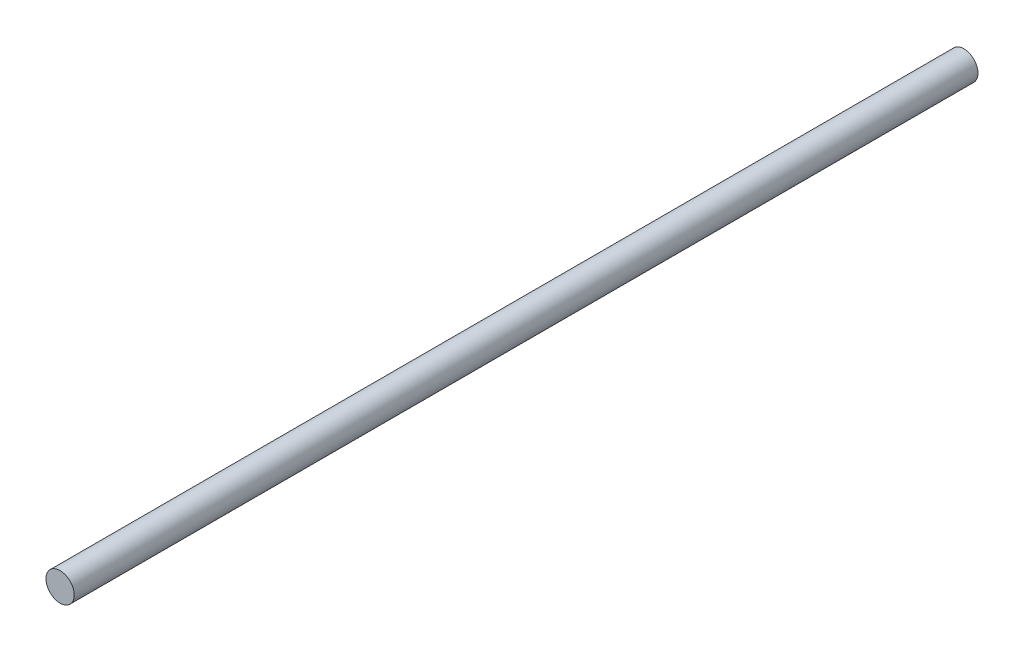
ISO-10303-21;
HEADER;
FILE_DESCRIPTION(('STEP AP214'),'2;1');
FILE_NAME('part.step','',(''),(''),'','','');
FILE_SCHEMA(('AUTOMOTIVE_DESIGN { 1 0 10303 214 1 1 1 1 }'));
ENDSEC;
DATA;
#1=APPLICATION_CONTEXT('core data for automotive mechanical design processes');
#2=APPLICATION_PROTOCOL_DEFINITION('international standard','automotive_design',2000,#1);
#3=PRODUCT_CONTEXT('',#1,'mechanical');
#4=PRODUCT('Part','Part','',(#3));
#5=PRODUCT_RELATED_PRODUCT_CATEGORY('part','',(#4));
#6=PRODUCT_DEFINITION_FORMATION('','',#4);
#7=PRODUCT_DEFINITION_CONTEXT('part definition',#1,'design');
#8=PRODUCT_DEFINITION('design','',#6,#7);
#9=PRODUCT_DEFINITION_SHAPE('','',#8);
#10=(LENGTH_UNIT() NAMED_UNIT(*) SI_UNIT(.MILLI.,.METRE.));
#11=(NAMED_UNIT(*) PLANE_ANGLE_UNIT() SI_UNIT($,.RADIAN.));
#12=(NAMED_UNIT(*) SI_UNIT($,.STERADIAN.) SOLID_ANGLE_UNIT());
#13=UNCERTAINTY_MEASURE_WITH_UNIT(LENGTH_MEASURE(1.E-05),#10,'distance_accuracy_value','');
#14=(GEOMETRIC_REPRESENTATION_CONTEXT(3) GLOBAL_UNCERTAINTY_ASSIGNED_CONTEXT((#13)) GLOBAL_UNIT_ASSIGNED_CONTEXT((#10,
#11,#12)) REPRESENTATION_CONTEXT('',''));
#15=CARTESIAN_POINT('',(0.,0.,0.));
#16=DIRECTION('',(0.,0.,1.));
#17=DIRECTION('',(1.,0.,0.));
#18=AXIS2_PLACEMENT_3D('',#15,#16,#17);
#19=CARTESIAN_POINT('',(0.,0.,96.));
#20=DIRECTION('',(0.,0.,-1.));
#21=DIRECTION('',(-1.,0.,0.));
#22=AXIS2_PLACEMENT_3D('',#19,#20,#21);
#23=CYLINDRICAL_SURFACE('',#22,1.5);
#24=CARTESIAN_POINT('',(0.,0.,96.));
#25=DIRECTION('',(0.,0.,1.));
#26=DIRECTION('',(1.,0.,0.));
#27=AXIS2_PLACEMENT_3D('',#24,#25,#26);
#28=CIRCLE('',#27,1.5);
#29=CARTESIAN_POINT('',(1.5,0.,96.));
#30=VERTEX_POINT('',#29);
#31=EDGE_CURVE('E10',#30,#30,#28,.T.);
#32=ORIENTED_EDGE('',*,*,#31,.F.);
#33=EDGE_LOOP('',(#32));
#34=FACE_BOUND('',#33,.T.);
#35=CARTESIAN_POINT('',(0.,0.,0.));
#36=DIRECTION('',(0.,0.,1.));
#37=DIRECTION('',(1.,0.,0.));
#38=AXIS2_PLACEMENT_3D('',#35,#36,#37);
#39=CIRCLE('',#38,1.5);
#40=CARTESIAN_POINT('',(1.5,0.,0.));
#41=VERTEX_POINT('',#40);
#42=EDGE_CURVE('E33',#41,#41,#39,.T.);
#43=ORIENTED_EDGE('',*,*,#42,.T.);
#44=EDGE_LOOP('',(#43));
#45=FACE_BOUND('',#44,.T.);
#46=ADVANCED_FACE('F30',(#34,#45),#23,.T.);
#47=CARTESIAN_POINT('',(0.,0.,96.));
#48=DIRECTION('',(0.,0.,1.));
#49=DIRECTION('',(1.,0.,0.));
#50=AXIS2_PLACEMENT_3D('',#47,#48,#49);
#51=PLANE('',#50);
#52=ORIENTED_EDGE('',*,*,#31,.T.);
#53=EDGE_LOOP('',(#52));
#54=FACE_BOUND('',#53,.T.);
#55=ADVANCED_FACE('F45',(#54),#51,.T.);
#56=CARTESIAN_POINT('',(0.,0.,0.));
#57=DIRECTION('',(0.,0.,1.));
#58=DIRECTION('',(1.,0.,0.));
#59=AXIS2_PLACEMENT_3D('',#56,#57,#58);
#60=PLANE('',#59);
#61=ORIENTED_EDGE('',*,*,#42,.F.);
#62=EDGE_LOOP('',(#61));
#63=FACE_BOUND('',#62,.T.);
#64=ADVANCED_FACE('F43',(#63),#60,.F.);
#65=CLOSED_SHELL('',(#46,#55,#64));
#66=MANIFOLD_SOLID_BREP('B2',#65);
#67=ADVANCED_BREP_SHAPE_REPRESENTATION('',(#18,#66),#14);
#68=SHAPE_DEFINITION_REPRESENTATION(#9,#67);
ENDSEC;
END-ISO-10303-21;
